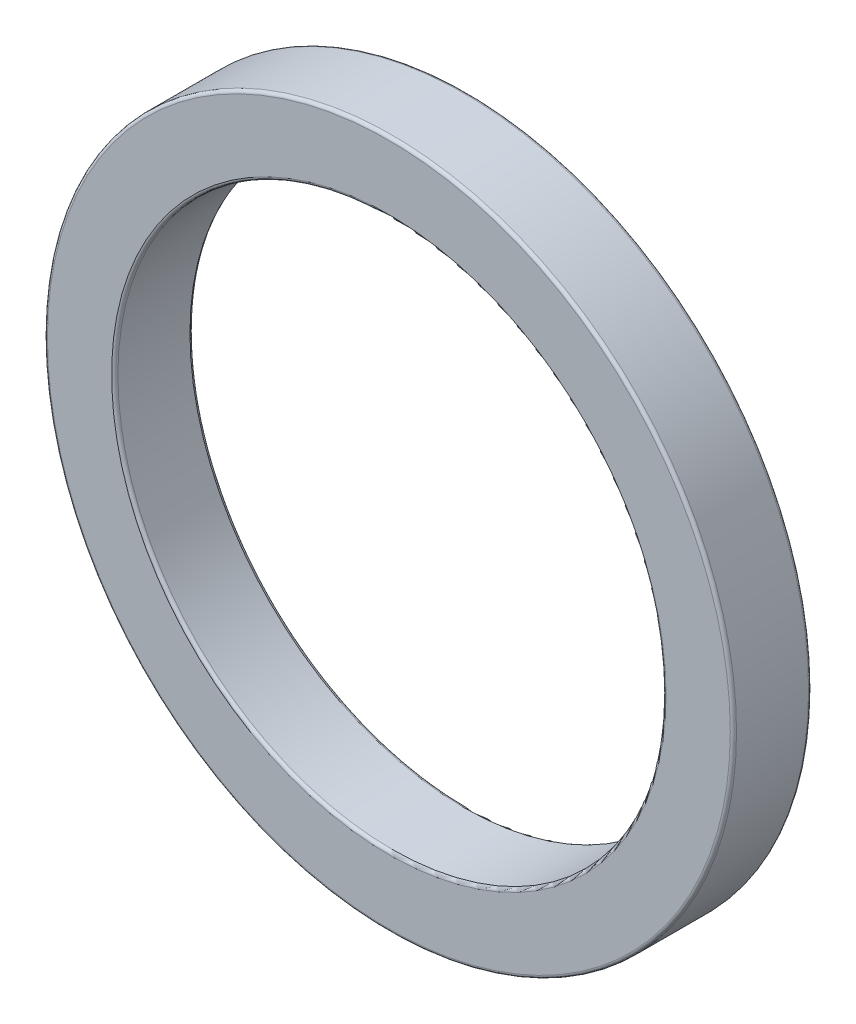
ISO-10303-21;
HEADER;
FILE_DESCRIPTION(('STEP AP214'),'2;1');
FILE_NAME('part.step','',(''),(''),'','','');
FILE_SCHEMA(('AUTOMOTIVE_DESIGN { 1 0 10303 214 1 1 1 1 }'));
ENDSEC;
DATA;
#1=APPLICATION_CONTEXT('core data for automotive mechanical design processes');
#2=APPLICATION_PROTOCOL_DEFINITION('international standard','automotive_design',2000,#1);
#3=PRODUCT_CONTEXT('',#1,'mechanical');
#4=PRODUCT('Part','Part','',(#3));
#5=PRODUCT_RELATED_PRODUCT_CATEGORY('part','',(#4));
#6=PRODUCT_DEFINITION_FORMATION('','',#4);
#7=PRODUCT_DEFINITION_CONTEXT('part definition',#1,'design');
#8=PRODUCT_DEFINITION('design','',#6,#7);
#9=PRODUCT_DEFINITION_SHAPE('','',#8);
#10=(LENGTH_UNIT() NAMED_UNIT(*) SI_UNIT(.MILLI.,.METRE.));
#11=(NAMED_UNIT(*) PLANE_ANGLE_UNIT() SI_UNIT($,.RADIAN.));
#12=(NAMED_UNIT(*) SI_UNIT($,.STERADIAN.) SOLID_ANGLE_UNIT());
#13=UNCERTAINTY_MEASURE_WITH_UNIT(LENGTH_MEASURE(1.E-05),#10,'distance_accuracy_value','');
#14=(GEOMETRIC_REPRESENTATION_CONTEXT(3) GLOBAL_UNCERTAINTY_ASSIGNED_CONTEXT((#13)) GLOBAL_UNIT_ASSIGNED_CONTEXT((#10,
#11,#12)) REPRESENTATION_CONTEXT('',''));
#15=CARTESIAN_POINT('',(0.,0.,0.));
#16=DIRECTION('',(0.,0.,1.));
#17=DIRECTION('',(1.,0.,0.));
#18=AXIS2_PLACEMENT_3D('',#15,#16,#17);
#19=CARTESIAN_POINT('',(0.,0.,5.));
#20=DIRECTION('',(0.,0.,1.));
#21=DIRECTION('',(1.,0.,0.));
#22=AXIS2_PLACEMENT_3D('',#19,#20,#21);
#23=PLANE('',#22);
#24=CARTESIAN_POINT('',(0.,0.,5.));
#25=DIRECTION('',(0.,0.,1.));
#26=DIRECTION('',(1.,0.,0.));
#27=AXIS2_PLACEMENT_3D('',#24,#25,#26);
#28=CIRCLE('',#27,21.8);
#29=CARTESIAN_POINT('',(21.8,0.,5.));
#30=VERTEX_POINT('',#29);
#31=EDGE_CURVE('E10',#30,#30,#28,.T.);
#32=ORIENTED_EDGE('',*,*,#31,.T.);
#33=EDGE_LOOP('',(#32));
#34=FACE_BOUND('',#33,.T.);
#35=CARTESIAN_POINT('',(0.,0.,5.));
#36=DIRECTION('',(0.,0.,1.));
#37=DIRECTION('',(1.,0.,0.));
#38=AXIS2_PLACEMENT_3D('',#35,#36,#37);
#39=CIRCLE('',#38,17.7);
#40=CARTESIAN_POINT('',(17.7,0.,5.));
#41=VERTEX_POINT('',#40);
#42=EDGE_CURVE('E42',#41,#41,#39,.F.);
#43=ORIENTED_EDGE('',*,*,#42,.T.);
#44=EDGE_LOOP('',(#43));
#45=FACE_BOUND('',#44,.T.);
#46=ADVANCED_FACE('F35',(#34,#45),#23,.T.);
#47=CARTESIAN_POINT('',(0.,0.,0.));
#48=DIRECTION('',(0.,0.,1.));
#49=DIRECTION('',(1.,0.,0.));
#50=AXIS2_PLACEMENT_3D('',#47,#48,#49);
#51=PLANE('',#50);
#52=CARTESIAN_POINT('',(0.,0.,0.));
#53=DIRECTION('',(0.,0.,1.));
#54=DIRECTION('',(1.,0.,0.));
#55=AXIS2_PLACEMENT_3D('',#52,#53,#54);
#56=CIRCLE('',#55,17.7);
#57=CARTESIAN_POINT('',(17.7,0.,0.));
#58=VERTEX_POINT('',#57);
#59=EDGE_CURVE('E61',#58,#58,#56,.T.);
#60=ORIENTED_EDGE('',*,*,#59,.T.);
#61=EDGE_LOOP('',(#60));
#62=FACE_BOUND('',#61,.T.);
#63=CARTESIAN_POINT('',(0.,0.,0.));
#64=DIRECTION('',(0.,0.,1.));
#65=DIRECTION('',(1.,0.,0.));
#66=AXIS2_PLACEMENT_3D('',#63,#64,#65);
#67=CIRCLE('',#66,21.8);
#68=CARTESIAN_POINT('',(21.8,0.,0.));
#69=VERTEX_POINT('',#68);
#70=EDGE_CURVE('E64',#69,#69,#67,.F.);
#71=ORIENTED_EDGE('',*,*,#70,.T.);
#72=EDGE_LOOP('',(#71));
#73=FACE_BOUND('',#72,.T.);
#74=ADVANCED_FACE('F68',(#62,#73),#51,.F.);
#75=CARTESIAN_POINT('',(0.,0.,5.));
#76=DIRECTION('',(0.,0.,-1.));
#77=DIRECTION('',(-1.,0.,0.));
#78=AXIS2_PLACEMENT_3D('',#75,#76,#77);
#79=CYLINDRICAL_SURFACE('',#78,22.);
#80=CARTESIAN_POINT('',(0.,0.,0.2));
#81=DIRECTION('',(0.,0.,1.));
#82=DIRECTION('',(1.,0.,0.));
#83=AXIS2_PLACEMENT_3D('',#80,#81,#82);
#84=CIRCLE('',#83,22.);
#85=CARTESIAN_POINT('',(22.,0.,0.2));
#86=VERTEX_POINT('',#85);
#87=EDGE_CURVE('E46',#86,#86,#84,.T.);
#88=ORIENTED_EDGE('',*,*,#87,.T.);
#89=EDGE_LOOP('',(#88));
#90=FACE_BOUND('',#89,.T.);
#91=CARTESIAN_POINT('',(0.,0.,4.8));
#92=DIRECTION('',(0.,0.,1.));
#93=DIRECTION('',(1.,0.,0.));
#94=AXIS2_PLACEMENT_3D('',#91,#92,#93);
#95=CIRCLE('',#94,22.);
#96=CARTESIAN_POINT('',(22.,0.,4.8));
#97=VERTEX_POINT('',#96);
#98=EDGE_CURVE('E50',#97,#97,#95,.F.);
#99=ORIENTED_EDGE('',*,*,#98,.T.);
#100=EDGE_LOOP('',(#99));
#101=FACE_BOUND('',#100,.T.);
#102=ADVANCED_FACE('F78',(#90,#101),#79,.T.);
#103=CARTESIAN_POINT('',(0.,0.,5.));
#104=DIRECTION('',(0.,0.,-1.));
#105=DIRECTION('',(-1.,0.,0.));
#106=AXIS2_PLACEMENT_3D('',#103,#104,#105);
#107=CYLINDRICAL_SURFACE('',#106,17.5);
#108=CARTESIAN_POINT('',(0.,0.,0.2));
#109=DIRECTION('',(0.,0.,1.));
#110=DIRECTION('',(1.,0.,0.));
#111=AXIS2_PLACEMENT_3D('',#108,#109,#110);
#112=CIRCLE('',#111,17.5);
#113=CARTESIAN_POINT('',(17.5,0.,0.2));
#114=VERTEX_POINT('',#113);
#115=EDGE_CURVE('E55',#114,#114,#112,.F.);
#116=ORIENTED_EDGE('',*,*,#115,.T.);
#117=EDGE_LOOP('',(#116));
#118=FACE_BOUND('',#117,.T.);
#119=CARTESIAN_POINT('',(0.,0.,4.8));
#120=DIRECTION('',(0.,0.,1.));
#121=DIRECTION('',(1.,0.,0.));
#122=AXIS2_PLACEMENT_3D('',#119,#120,#121);
#123=CIRCLE('',#122,17.5);
#124=CARTESIAN_POINT('',(17.5,0.,4.8));
#125=VERTEX_POINT('',#124);
#126=EDGE_CURVE('E58',#125,#125,#123,.T.);
#127=ORIENTED_EDGE('',*,*,#126,.T.);
#128=EDGE_LOOP('',(#127));
#129=FACE_BOUND('',#128,.T.);
#130=ADVANCED_FACE('F81',(#118,#129),#107,.F.);
#131=CARTESIAN_POINT('',(0.,0.,0.2));
#132=DIRECTION('',(0.,0.,1.));
#133=DIRECTION('',(1.,0.,0.));
#134=AXIS2_PLACEMENT_3D('',#131,#132,#133);
#135=TOROIDAL_SURFACE('',#134,17.7,0.2);
#136=ORIENTED_EDGE('',*,*,#115,.F.);
#137=EDGE_LOOP('',(#136));
#138=FACE_BOUND('',#137,.T.);
#139=ORIENTED_EDGE('',*,*,#59,.F.);
#140=EDGE_LOOP('',(#139));
#141=FACE_BOUND('',#140,.T.);
#142=ADVANCED_FACE('F74',(#138,#141),#135,.T.);
#143=CARTESIAN_POINT('',(0.,0.,0.2));
#144=DIRECTION('',(0.,0.,1.));
#145=DIRECTION('',(1.,0.,0.));
#146=AXIS2_PLACEMENT_3D('',#143,#144,#145);
#147=TOROIDAL_SURFACE('',#146,21.8,0.2);
#148=ORIENTED_EDGE('',*,*,#70,.F.);
#149=EDGE_LOOP('',(#148));
#150=FACE_BOUND('',#149,.T.);
#151=ORIENTED_EDGE('',*,*,#87,.F.);
#152=EDGE_LOOP('',(#151));
#153=FACE_BOUND('',#152,.T.);
#154=ADVANCED_FACE('F70',(#150,#153),#147,.T.);
#155=CARTESIAN_POINT('',(0.,0.,4.8));
#156=DIRECTION('',(0.,0.,1.));
#157=DIRECTION('',(1.,0.,0.));
#158=AXIS2_PLACEMENT_3D('',#155,#156,#157);
#159=TOROIDAL_SURFACE('',#158,21.8,0.2);
#160=ORIENTED_EDGE('',*,*,#98,.F.);
#161=EDGE_LOOP('',(#160));
#162=FACE_BOUND('',#161,.T.);
#163=ORIENTED_EDGE('',*,*,#31,.F.);
#164=EDGE_LOOP('',(#163));
#165=FACE_BOUND('',#164,.T.);
#166=ADVANCED_FACE('F73',(#162,#165),#159,.T.);
#167=CARTESIAN_POINT('',(0.,0.,4.8));
#168=DIRECTION('',(0.,0.,1.));
#169=DIRECTION('',(1.,0.,0.));
#170=AXIS2_PLACEMENT_3D('',#167,#168,#169);
#171=TOROIDAL_SURFACE('',#170,17.7,0.2);
#172=ORIENTED_EDGE('',*,*,#42,.F.);
#173=EDGE_LOOP('',(#172));
#174=FACE_BOUND('',#173,.T.);
#175=ORIENTED_EDGE('',*,*,#126,.F.);
#176=EDGE_LOOP('',(#175));
#177=FACE_BOUND('',#176,.T.);
#178=ADVANCED_FACE('F37',(#174,#177),#171,.T.);
#179=CLOSED_SHELL('',(#46,#74,#102,#130,#142,#154,#166,#178));
#180=MANIFOLD_SOLID_BREP('B2',#179);
#181=ADVANCED_BREP_SHAPE_REPRESENTATION('',(#18,#180),#14);
#182=SHAPE_DEFINITION_REPRESENTATION(#9,#181);
ENDSEC;
END-ISO-10303-21;
